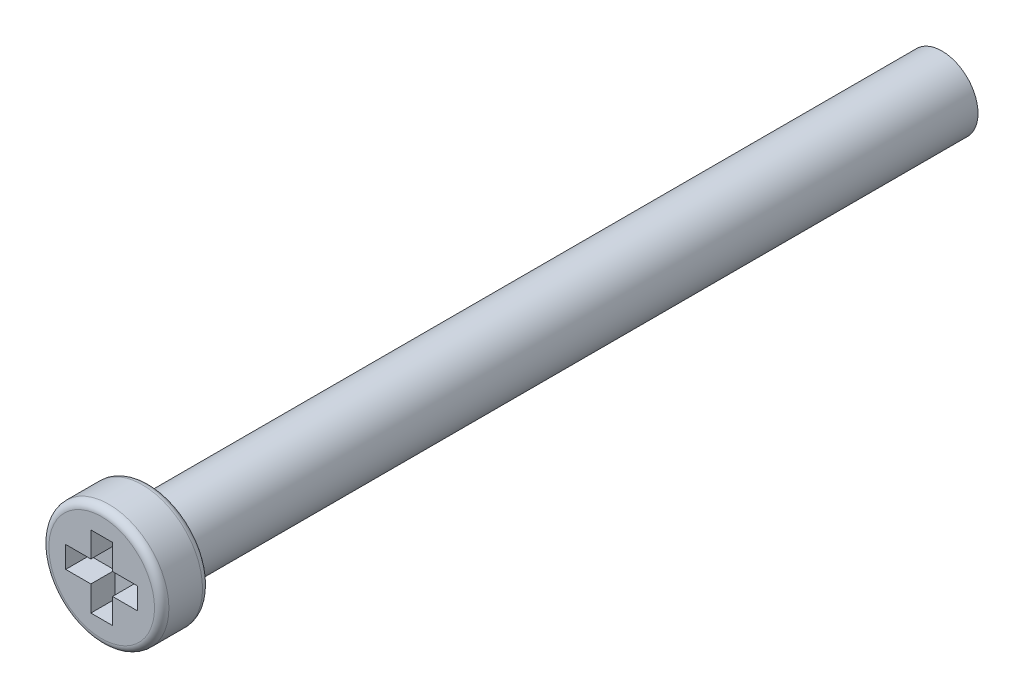
ISO-10303-21;
HEADER;
FILE_DESCRIPTION(('STEP AP214'),'2;1');
FILE_NAME('part.step','',(''),(''),'','','');
FILE_SCHEMA(('AUTOMOTIVE_DESIGN { 1 0 10303 214 1 1 1 1 }'));
ENDSEC;
DATA;
#1=APPLICATION_CONTEXT('core data for automotive mechanical design processes');
#2=APPLICATION_PROTOCOL_DEFINITION('international standard','automotive_design',2000,#1);
#3=PRODUCT_CONTEXT('',#1,'mechanical');
#4=PRODUCT('Part','Part','',(#3));
#5=PRODUCT_RELATED_PRODUCT_CATEGORY('part','',(#4));
#6=PRODUCT_DEFINITION_FORMATION('','',#4);
#7=PRODUCT_DEFINITION_CONTEXT('part definition',#1,'design');
#8=PRODUCT_DEFINITION('design','',#6,#7);
#9=PRODUCT_DEFINITION_SHAPE('','',#8);
#10=(LENGTH_UNIT() NAMED_UNIT(*) SI_UNIT(.MILLI.,.METRE.));
#11=(NAMED_UNIT(*) PLANE_ANGLE_UNIT() SI_UNIT($,.RADIAN.));
#12=(NAMED_UNIT(*) SI_UNIT($,.STERADIAN.) SOLID_ANGLE_UNIT());
#13=UNCERTAINTY_MEASURE_WITH_UNIT(LENGTH_MEASURE(1.E-05),#10,'distance_accuracy_value','');
#14=(GEOMETRIC_REPRESENTATION_CONTEXT(3) GLOBAL_UNCERTAINTY_ASSIGNED_CONTEXT((#13)) GLOBAL_UNIT_ASSIGNED_CONTEXT((#10,
#11,#12)) REPRESENTATION_CONTEXT('',''));
#15=CARTESIAN_POINT('',(0.,0.,0.));
#16=DIRECTION('',(0.,0.,1.));
#17=DIRECTION('',(1.,0.,0.));
#18=AXIS2_PLACEMENT_3D('',#15,#16,#17);
#19=CARTESIAN_POINT('',(0.,0.,0.));
#20=DIRECTION('',(0.,0.,1.));
#21=DIRECTION('',(1.,0.,0.));
#22=AXIS2_PLACEMENT_3D('',#19,#20,#21);
#23=PLANE('',#22);
#24=CARTESIAN_POINT('',(0.,0.,0.));
#25=DIRECTION('',(0.,0.,1.));
#26=DIRECTION('',(1.,0.,0.));
#27=AXIS2_PLACEMENT_3D('',#24,#25,#26);
#28=CIRCLE('',#27,1.6);
#29=CARTESIAN_POINT('',(1.6,0.,0.));
#30=VERTEX_POINT('',#29);
#31=EDGE_CURVE('E11',#30,#30,#28,.T.);
#32=ORIENTED_EDGE('',*,*,#31,.T.);
#33=EDGE_LOOP('',(#32));
#34=FACE_BOUND('',#33,.T.);
#35=CARTESIAN_POINT('',(0.,0.,0.));
#36=DIRECTION('',(0.,0.,1.));
#37=DIRECTION('',(1.,0.,0.));
#38=AXIS2_PLACEMENT_3D('',#35,#36,#37);
#39=CIRCLE('',#38,2.2);
#40=CARTESIAN_POINT('',(2.2,0.,0.));
#41=VERTEX_POINT('',#40);
#42=EDGE_CURVE('E218',#41,#41,#39,.F.);
#43=ORIENTED_EDGE('',*,*,#42,.T.);
#44=EDGE_LOOP('',(#43));
#45=FACE_BOUND('',#44,.T.);
#46=ADVANCED_FACE('F36',(#34,#45),#23,.F.);
#47=CARTESIAN_POINT('',(0.,0.,2.));
#48=DIRECTION('',(0.,0.,-1.));
#49=DIRECTION('',(-1.,0.,0.));
#50=AXIS2_PLACEMENT_3D('',#47,#48,#49);
#51=CYLINDRICAL_SURFACE('',#50,2.5);
#52=CARTESIAN_POINT('',(0.,0.,0.3));
#53=DIRECTION('',(0.,0.,1.));
#54=DIRECTION('',(1.,0.,0.));
#55=AXIS2_PLACEMENT_3D('',#52,#53,#54);
#56=CIRCLE('',#55,2.5);
#57=CARTESIAN_POINT('',(2.5,0.,0.3));
#58=VERTEX_POINT('',#57);
#59=EDGE_CURVE('E215',#58,#58,#56,.T.);
#60=ORIENTED_EDGE('',*,*,#59,.T.);
#61=EDGE_LOOP('',(#60));
#62=FACE_BOUND('',#61,.T.);
#63=CARTESIAN_POINT('',(0.,0.,1.7));
#64=DIRECTION('',(0.,0.,1.));
#65=DIRECTION('',(1.,0.,0.));
#66=AXIS2_PLACEMENT_3D('',#63,#64,#65);
#67=CIRCLE('',#66,2.5);
#68=CARTESIAN_POINT('',(2.5,0.,1.7));
#69=VERTEX_POINT('',#68);
#70=EDGE_CURVE('E212',#69,#69,#67,.F.);
#71=ORIENTED_EDGE('',*,*,#70,.T.);
#72=EDGE_LOOP('',(#71));
#73=FACE_BOUND('',#72,.T.);
#74=ADVANCED_FACE('F238',(#62,#73),#51,.T.);
#75=CARTESIAN_POINT('',(0.,0.,2.));
#76=DIRECTION('',(0.,0.,1.));
#77=DIRECTION('',(1.,0.,0.));
#78=AXIS2_PLACEMENT_3D('',#75,#76,#77);
#79=PLANE('',#78);
#80=DIRECTION('',(0.,1.,0.));
#81=VECTOR('',#80,1.);
#82=CARTESIAN_POINT('',(0.45,-0.45,2.));
#83=LINE('',#82,#81);
#84=CARTESIAN_POINT('',(0.45,-1.5,2.));
#85=VERTEX_POINT('',#84);
#86=CARTESIAN_POINT('',(0.45,-0.45,2.));
#87=VERTEX_POINT('',#86);
#88=EDGE_CURVE('E51',#85,#87,#83,.T.);
#89=ORIENTED_EDGE('',*,*,#88,.F.);
#90=DIRECTION('',(1.,0.,0.));
#91=VECTOR('',#90,1.);
#92=CARTESIAN_POINT('',(-0.45,-1.5,2.));
#93=LINE('',#92,#91);
#94=CARTESIAN_POINT('',(-0.45,-1.5,2.));
#95=VERTEX_POINT('',#94);
#96=EDGE_CURVE('E188',#95,#85,#93,.T.);
#97=ORIENTED_EDGE('',*,*,#96,.F.);
#98=DIRECTION('',(0.,-1.,0.));
#99=VECTOR('',#98,1.);
#100=CARTESIAN_POINT('',(-0.45,-0.45,2.));
#101=LINE('',#100,#99);
#102=CARTESIAN_POINT('',(-0.45,-0.45,2.));
#103=VERTEX_POINT('',#102);
#104=EDGE_CURVE('E186',#103,#95,#101,.T.);
#105=ORIENTED_EDGE('',*,*,#104,.F.);
#106=DIRECTION('',(1.,0.,0.));
#107=VECTOR('',#106,1.);
#108=CARTESIAN_POINT('',(-1.5,-0.45,2.));
#109=LINE('',#108,#107);
#110=CARTESIAN_POINT('',(-1.5,-0.45,2.));
#111=VERTEX_POINT('',#110);
#112=EDGE_CURVE('E135',#111,#103,#109,.T.);
#113=ORIENTED_EDGE('',*,*,#112,.F.);
#114=DIRECTION('',(0.,-1.,0.));
#115=VECTOR('',#114,1.);
#116=CARTESIAN_POINT('',(-1.5,0.45,2.));
#117=LINE('',#116,#115);
#118=CARTESIAN_POINT('',(-1.5,0.45,2.));
#119=VERTEX_POINT('',#118);
#120=EDGE_CURVE('E182',#119,#111,#117,.T.);
#121=ORIENTED_EDGE('',*,*,#120,.F.);
#122=DIRECTION('',(-1.,0.,0.));
#123=VECTOR('',#122,1.);
#124=CARTESIAN_POINT('',(-1.5,0.45,2.));
#125=LINE('',#124,#123);
#126=CARTESIAN_POINT('',(-0.45,0.45,2.));
#127=VERTEX_POINT('',#126);
#128=EDGE_CURVE('E179',#127,#119,#125,.T.);
#129=ORIENTED_EDGE('',*,*,#128,.F.);
#130=DIRECTION('',(0.,-1.,0.));
#131=VECTOR('',#130,1.);
#132=CARTESIAN_POINT('',(-0.45,1.5,2.));
#133=LINE('',#132,#131);
#134=CARTESIAN_POINT('',(-0.45,1.5,2.));
#135=VERTEX_POINT('',#134);
#136=EDGE_CURVE('E176',#135,#127,#133,.T.);
#137=ORIENTED_EDGE('',*,*,#136,.F.);
#138=DIRECTION('',(-1.,0.,0.));
#139=VECTOR('',#138,1.);
#140=CARTESIAN_POINT('',(-0.45,1.5,2.));
#141=LINE('',#140,#139);
#142=CARTESIAN_POINT('',(0.45,1.5,2.));
#143=VERTEX_POINT('',#142);
#144=EDGE_CURVE('E173',#143,#135,#141,.T.);
#145=ORIENTED_EDGE('',*,*,#144,.F.);
#146=DIRECTION('',(0.,1.,0.));
#147=VECTOR('',#146,1.);
#148=CARTESIAN_POINT('',(0.45,1.5,2.));
#149=LINE('',#148,#147);
#150=CARTESIAN_POINT('',(0.45,0.45,2.));
#151=VERTEX_POINT('',#150);
#152=EDGE_CURVE('E170',#151,#143,#149,.T.);
#153=ORIENTED_EDGE('',*,*,#152,.F.);
#154=DIRECTION('',(-1.,0.,0.));
#155=VECTOR('',#154,1.);
#156=CARTESIAN_POINT('',(0.45,0.45,2.));
#157=LINE('',#156,#155);
#158=CARTESIAN_POINT('',(1.5,0.45,2.));
#159=VERTEX_POINT('',#158);
#160=EDGE_CURVE('E167',#159,#151,#157,.T.);
#161=ORIENTED_EDGE('',*,*,#160,.F.);
#162=DIRECTION('',(0.,1.,0.));
#163=VECTOR('',#162,1.);
#164=CARTESIAN_POINT('',(1.5,0.45,2.));
#165=LINE('',#164,#163);
#166=CARTESIAN_POINT('',(1.5,-0.45,2.));
#167=VERTEX_POINT('',#166);
#168=EDGE_CURVE('E164',#167,#159,#165,.T.);
#169=ORIENTED_EDGE('',*,*,#168,.F.);
#170=DIRECTION('',(1.,0.,0.));
#171=VECTOR('',#170,1.);
#172=CARTESIAN_POINT('',(0.45,-0.45,2.));
#173=LINE('',#172,#171);
#174=EDGE_CURVE('E161',#87,#167,#173,.T.);
#175=ORIENTED_EDGE('',*,*,#174,.F.);
#176=EDGE_LOOP('',(#89,#97,#105,#113,#121,#129,#137,#145,#153,#161,#169,#175));
#177=FACE_BOUND('',#176,.T.);
#178=CARTESIAN_POINT('',(0.,0.,2.));
#179=DIRECTION('',(0.,0.,1.));
#180=DIRECTION('',(1.,0.,0.));
#181=AXIS2_PLACEMENT_3D('',#178,#179,#180);
#182=CIRCLE('',#181,2.2);
#183=CARTESIAN_POINT('',(2.2,0.,2.));
#184=VERTEX_POINT('',#183);
#185=EDGE_CURVE('E221',#184,#184,#182,.T.);
#186=ORIENTED_EDGE('',*,*,#185,.T.);
#187=EDGE_LOOP('',(#186));
#188=FACE_BOUND('',#187,.T.);
#189=ADVANCED_FACE('F244',(#177,#188),#79,.T.);
#190=CARTESIAN_POINT('',(0.,0.,-33.));
#191=DIRECTION('',(0.,0.,1.));
#192=DIRECTION('',(1.,0.,0.));
#193=AXIS2_PLACEMENT_3D('',#190,#191,#192);
#194=CYLINDRICAL_SURFACE('',#193,1.5);
#195=CARTESIAN_POINT('',(0.,0.,-0.100000000000003));
#196=DIRECTION('',(0.,0.,1.));
#197=DIRECTION('',(1.,0.,0.));
#198=AXIS2_PLACEMENT_3D('',#195,#196,#197);
#199=CIRCLE('',#198,1.5);
#200=CARTESIAN_POINT('',(1.5,0.,-0.100000000000003));
#201=VERTEX_POINT('',#200);
#202=EDGE_CURVE('E44',#201,#201,#199,.F.);
#203=ORIENTED_EDGE('',*,*,#202,.T.);
#204=EDGE_LOOP('',(#203));
#205=FACE_BOUND('',#204,.T.);
#206=CARTESIAN_POINT('',(0.,0.,-33.));
#207=DIRECTION('',(0.,0.,-1.));
#208=DIRECTION('',(-1.,0.,0.));
#209=AXIS2_PLACEMENT_3D('',#206,#207,#208);
#210=CIRCLE('',#209,1.5);
#211=CARTESIAN_POINT('',(-1.5,0.,-33.));
#212=VERTEX_POINT('',#211);
#213=EDGE_CURVE('E192',#212,#212,#210,.T.);
#214=ORIENTED_EDGE('',*,*,#213,.F.);
#215=EDGE_LOOP('',(#214));
#216=FACE_BOUND('',#215,.T.);
#217=ADVANCED_FACE('F226',(#205,#216),#194,.T.);
#218=CARTESIAN_POINT('',(0.,0.,-33.));
#219=DIRECTION('',(0.,0.,-1.));
#220=DIRECTION('',(-1.,0.,0.));
#221=AXIS2_PLACEMENT_3D('',#218,#219,#220);
#222=PLANE('',#221);
#223=ORIENTED_EDGE('',*,*,#213,.T.);
#224=EDGE_LOOP('',(#223));
#225=FACE_BOUND('',#224,.T.);
#226=ADVANCED_FACE('F254',(#225),#222,.T.);
#227=CARTESIAN_POINT('',(0.,0.,0.3));
#228=DIRECTION('',(0.,0.,1.));
#229=DIRECTION('',(1.,0.,0.));
#230=AXIS2_PLACEMENT_3D('',#227,#228,#229);
#231=TOROIDAL_SURFACE('',#230,2.2,0.3);
#232=ORIENTED_EDGE('',*,*,#42,.F.);
#233=EDGE_LOOP('',(#232));
#234=FACE_BOUND('',#233,.T.);
#235=ORIENTED_EDGE('',*,*,#59,.F.);
#236=EDGE_LOOP('',(#235));
#237=FACE_BOUND('',#236,.T.);
#238=ADVANCED_FACE('F251',(#234,#237),#231,.T.);
#239=CARTESIAN_POINT('',(0.,0.,1.7));
#240=DIRECTION('',(0.,0.,1.));
#241=DIRECTION('',(1.,0.,0.));
#242=AXIS2_PLACEMENT_3D('',#239,#240,#241);
#243=TOROIDAL_SURFACE('',#242,2.2,0.3);
#244=ORIENTED_EDGE('',*,*,#70,.F.);
#245=EDGE_LOOP('',(#244));
#246=FACE_BOUND('',#245,.T.);
#247=ORIENTED_EDGE('',*,*,#185,.F.);
#248=EDGE_LOOP('',(#247));
#249=FACE_BOUND('',#248,.T.);
#250=ADVANCED_FACE('F253',(#246,#249),#243,.T.);
#251=CARTESIAN_POINT('',(0.45,-0.45,1.));
#252=DIRECTION('',(1.,0.,0.));
#253=DIRECTION('',(0.,1.,0.));
#254=AXIS2_PLACEMENT_3D('',#251,#252,#253);
#255=PLANE('',#254);
#256=ORIENTED_EDGE('',*,*,#88,.T.);
#257=DIRECTION('',(0.,0.,1.));
#258=VECTOR('',#257,1.);
#259=CARTESIAN_POINT('',(0.45,-0.45,1.));
#260=LINE('',#259,#258);
#261=CARTESIAN_POINT('',(0.45,-0.45,1.));
#262=VERTEX_POINT('',#261);
#263=EDGE_CURVE('E99',#262,#87,#260,.T.);
#264=ORIENTED_EDGE('',*,*,#263,.F.);
#265=DIRECTION('',(0.,1.,0.));
#266=VECTOR('',#265,1.);
#267=CARTESIAN_POINT('',(0.45,-0.45,1.));
#268=LINE('',#267,#266);
#269=CARTESIAN_POINT('',(0.45,-1.5,1.));
#270=VERTEX_POINT('',#269);
#271=EDGE_CURVE('E190',#270,#262,#268,.T.);
#272=ORIENTED_EDGE('',*,*,#271,.F.);
#273=DIRECTION('',(0.,0.,1.));
#274=VECTOR('',#273,1.);
#275=CARTESIAN_POINT('',(0.45,-1.5,1.));
#276=LINE('',#275,#274);
#277=EDGE_CURVE('E59',#270,#85,#276,.T.);
#278=ORIENTED_EDGE('',*,*,#277,.T.);
#279=EDGE_LOOP('',(#256,#264,#272,#278));
#280=FACE_BOUND('',#279,.T.);
#281=ADVANCED_FACE('F257',(#280),#255,.F.);
#282=CARTESIAN_POINT('',(-0.45,-1.5,1.));
#283=DIRECTION('',(0.,-1.,0.));
#284=DIRECTION('',(0.,0.,-1.));
#285=AXIS2_PLACEMENT_3D('',#282,#283,#284);
#286=PLANE('',#285);
#287=ORIENTED_EDGE('',*,*,#96,.T.);
#288=ORIENTED_EDGE('',*,*,#277,.F.);
#289=DIRECTION('',(1.,0.,0.));
#290=VECTOR('',#289,1.);
#291=CARTESIAN_POINT('',(-0.45,-1.5,1.));
#292=LINE('',#291,#290);
#293=CARTESIAN_POINT('',(-0.45,-1.5,1.));
#294=VERTEX_POINT('',#293);
#295=EDGE_CURVE('E147',#294,#270,#292,.T.);
#296=ORIENTED_EDGE('',*,*,#295,.F.);
#297=DIRECTION('',(0.,0.,1.));
#298=VECTOR('',#297,1.);
#299=CARTESIAN_POINT('',(-0.45,-1.5,1.));
#300=LINE('',#299,#298);
#301=EDGE_CURVE('E139',#294,#95,#300,.T.);
#302=ORIENTED_EDGE('',*,*,#301,.T.);
#303=EDGE_LOOP('',(#287,#288,#296,#302));
#304=FACE_BOUND('',#303,.T.);
#305=ADVANCED_FACE('F262',(#304),#286,.F.);
#306=CARTESIAN_POINT('',(-0.45,-0.45,1.));
#307=DIRECTION('',(-1.,0.,0.));
#308=DIRECTION('',(0.,-1.,0.));
#309=AXIS2_PLACEMENT_3D('',#306,#307,#308);
#310=PLANE('',#309);
#311=ORIENTED_EDGE('',*,*,#104,.T.);
#312=ORIENTED_EDGE('',*,*,#301,.F.);
#313=DIRECTION('',(0.,-1.,0.));
#314=VECTOR('',#313,1.);
#315=CARTESIAN_POINT('',(-0.45,-0.45,1.));
#316=LINE('',#315,#314);
#317=CARTESIAN_POINT('',(-0.45,-0.45,1.));
#318=VERTEX_POINT('',#317);
#319=EDGE_CURVE('E143',#318,#294,#316,.T.);
#320=ORIENTED_EDGE('',*,*,#319,.F.);
#321=DIRECTION('',(0.,0.,1.));
#322=VECTOR('',#321,1.);
#323=CARTESIAN_POINT('',(-0.45,-0.45,1.));
#324=LINE('',#323,#322);
#325=EDGE_CURVE('E128',#318,#103,#324,.T.);
#326=ORIENTED_EDGE('',*,*,#325,.T.);
#327=EDGE_LOOP('',(#311,#312,#320,#326));
#328=FACE_BOUND('',#327,.T.);
#329=ADVANCED_FACE('F144',(#328),#310,.F.);
#330=CARTESIAN_POINT('',(-1.5,-0.45,1.));
#331=DIRECTION('',(0.,-1.,0.));
#332=DIRECTION('',(1.,0.,0.));
#333=AXIS2_PLACEMENT_3D('',#330,#331,#332);
#334=PLANE('',#333);
#335=ORIENTED_EDGE('',*,*,#112,.T.);
#336=ORIENTED_EDGE('',*,*,#325,.F.);
#337=DIRECTION('',(1.,0.,0.));
#338=VECTOR('',#337,1.);
#339=CARTESIAN_POINT('',(-1.5,-0.45,1.));
#340=LINE('',#339,#338);
#341=CARTESIAN_POINT('',(-1.5,-0.45,1.));
#342=VERTEX_POINT('',#341);
#343=EDGE_CURVE('E132',#342,#318,#340,.T.);
#344=ORIENTED_EDGE('',*,*,#343,.F.);
#345=DIRECTION('',(0.,0.,1.));
#346=VECTOR('',#345,1.);
#347=CARTESIAN_POINT('',(-1.5,-0.45,1.));
#348=LINE('',#347,#346);
#349=EDGE_CURVE('E140',#342,#111,#348,.T.);
#350=ORIENTED_EDGE('',*,*,#349,.T.);
#351=EDGE_LOOP('',(#335,#336,#344,#350));
#352=FACE_BOUND('',#351,.T.);
#353=ADVANCED_FACE('F130',(#352),#334,.F.);
#354=CARTESIAN_POINT('',(-1.5,0.45,1.));
#355=DIRECTION('',(-1.,0.,0.));
#356=DIRECTION('',(0.,-1.,0.));
#357=AXIS2_PLACEMENT_3D('',#354,#355,#356);
#358=PLANE('',#357);
#359=ORIENTED_EDGE('',*,*,#120,.T.);
#360=ORIENTED_EDGE('',*,*,#349,.F.);
#361=DIRECTION('',(0.,-1.,0.));
#362=VECTOR('',#361,1.);
#363=CARTESIAN_POINT('',(-1.5,0.45,1.));
#364=LINE('',#363,#362);
#365=CARTESIAN_POINT('',(-1.5,0.45,1.));
#366=VERTEX_POINT('',#365);
#367=EDGE_CURVE('E153',#366,#342,#364,.T.);
#368=ORIENTED_EDGE('',*,*,#367,.F.);
#369=DIRECTION('',(0.,0.,1.));
#370=VECTOR('',#369,1.);
#371=CARTESIAN_POINT('',(-1.5,0.45,1.));
#372=LINE('',#371,#370);
#373=EDGE_CURVE('E195',#366,#119,#372,.T.);
#374=ORIENTED_EDGE('',*,*,#373,.T.);
#375=EDGE_LOOP('',(#359,#360,#368,#374));
#376=FACE_BOUND('',#375,.T.);
#377=ADVANCED_FACE('F305',(#376),#358,.F.);
#378=CARTESIAN_POINT('',(-1.5,0.45,1.));
#379=DIRECTION('',(0.,1.,0.));
#380=DIRECTION('',(0.,0.,1.));
#381=AXIS2_PLACEMENT_3D('',#378,#379,#380);
#382=PLANE('',#381);
#383=ORIENTED_EDGE('',*,*,#128,.T.);
#384=ORIENTED_EDGE('',*,*,#373,.F.);
#385=DIRECTION('',(-1.,0.,0.));
#386=VECTOR('',#385,1.);
#387=CARTESIAN_POINT('',(-1.5,0.45,1.));
#388=LINE('',#387,#386);
#389=CARTESIAN_POINT('',(-0.45,0.45,1.));
#390=VERTEX_POINT('',#389);
#391=EDGE_CURVE('E155',#390,#366,#388,.T.);
#392=ORIENTED_EDGE('',*,*,#391,.F.);
#393=DIRECTION('',(0.,0.,1.));
#394=VECTOR('',#393,1.);
#395=CARTESIAN_POINT('',(-0.45,0.45,1.));
#396=LINE('',#395,#394);
#397=EDGE_CURVE('E197',#390,#127,#396,.T.);
#398=ORIENTED_EDGE('',*,*,#397,.T.);
#399=EDGE_LOOP('',(#383,#384,#392,#398));
#400=FACE_BOUND('',#399,.T.);
#401=ADVANCED_FACE('F301',(#400),#382,.F.);
#402=CARTESIAN_POINT('',(-0.45,1.5,1.));
#403=DIRECTION('',(-1.,0.,0.));
#404=DIRECTION('',(0.,-1.,0.));
#405=AXIS2_PLACEMENT_3D('',#402,#403,#404);
#406=PLANE('',#405);
#407=ORIENTED_EDGE('',*,*,#136,.T.);
#408=ORIENTED_EDGE('',*,*,#397,.F.);
#409=DIRECTION('',(0.,-1.,0.));
#410=VECTOR('',#409,1.);
#411=CARTESIAN_POINT('',(-0.45,1.5,1.));
#412=LINE('',#411,#410);
#413=CARTESIAN_POINT('',(-0.45,1.5,1.));
#414=VERTEX_POINT('',#413);
#415=EDGE_CURVE('E296',#414,#390,#412,.T.);
#416=ORIENTED_EDGE('',*,*,#415,.F.);
#417=DIRECTION('',(0.,0.,1.));
#418=VECTOR('',#417,1.);
#419=CARTESIAN_POINT('',(-0.45,1.5,1.));
#420=LINE('',#419,#418);
#421=EDGE_CURVE('E199',#414,#135,#420,.T.);
#422=ORIENTED_EDGE('',*,*,#421,.T.);
#423=EDGE_LOOP('',(#407,#408,#416,#422));
#424=FACE_BOUND('',#423,.T.);
#425=ADVANCED_FACE('F310',(#424),#406,.F.);
#426=CARTESIAN_POINT('',(-0.45,1.5,1.));
#427=DIRECTION('',(0.,1.,0.));
#428=DIRECTION('',(0.,0.,1.));
#429=AXIS2_PLACEMENT_3D('',#426,#427,#428);
#430=PLANE('',#429);
#431=ORIENTED_EDGE('',*,*,#144,.T.);
#432=ORIENTED_EDGE('',*,*,#421,.F.);
#433=DIRECTION('',(-1.,0.,0.));
#434=VECTOR('',#433,1.);
#435=CARTESIAN_POINT('',(-0.45,1.5,1.));
#436=LINE('',#435,#434);
#437=CARTESIAN_POINT('',(0.45,1.5,1.));
#438=VERTEX_POINT('',#437);
#439=EDGE_CURVE('E293',#438,#414,#436,.T.);
#440=ORIENTED_EDGE('',*,*,#439,.F.);
#441=DIRECTION('',(0.,0.,1.));
#442=VECTOR('',#441,1.);
#443=CARTESIAN_POINT('',(0.45,1.5,1.));
#444=LINE('',#443,#442);
#445=EDGE_CURVE('E201',#438,#143,#444,.T.);
#446=ORIENTED_EDGE('',*,*,#445,.T.);
#447=EDGE_LOOP('',(#431,#432,#440,#446));
#448=FACE_BOUND('',#447,.T.);
#449=ADVANCED_FACE('F313',(#448),#430,.F.);
#450=CARTESIAN_POINT('',(0.45,1.5,1.));
#451=DIRECTION('',(1.,0.,0.));
#452=DIRECTION('',(0.,1.,0.));
#453=AXIS2_PLACEMENT_3D('',#450,#451,#452);
#454=PLANE('',#453);
#455=ORIENTED_EDGE('',*,*,#152,.T.);
#456=ORIENTED_EDGE('',*,*,#445,.F.);
#457=DIRECTION('',(0.,1.,0.));
#458=VECTOR('',#457,1.);
#459=CARTESIAN_POINT('',(0.45,1.5,1.));
#460=LINE('',#459,#458);
#461=CARTESIAN_POINT('',(0.45,0.45,1.));
#462=VERTEX_POINT('',#461);
#463=EDGE_CURVE('E290',#462,#438,#460,.T.);
#464=ORIENTED_EDGE('',*,*,#463,.F.);
#465=DIRECTION('',(0.,0.,1.));
#466=VECTOR('',#465,1.);
#467=CARTESIAN_POINT('',(0.45,0.45,1.));
#468=LINE('',#467,#466);
#469=EDGE_CURVE('E203',#462,#151,#468,.T.);
#470=ORIENTED_EDGE('',*,*,#469,.T.);
#471=EDGE_LOOP('',(#455,#456,#464,#470));
#472=FACE_BOUND('',#471,.T.);
#473=ADVANCED_FACE('F316',(#472),#454,.F.);
#474=CARTESIAN_POINT('',(0.45,0.45,1.));
#475=DIRECTION('',(0.,1.,0.));
#476=DIRECTION('',(-1.,0.,0.));
#477=AXIS2_PLACEMENT_3D('',#474,#475,#476);
#478=PLANE('',#477);
#479=ORIENTED_EDGE('',*,*,#160,.T.);
#480=ORIENTED_EDGE('',*,*,#469,.F.);
#481=DIRECTION('',(-1.,0.,0.));
#482=VECTOR('',#481,1.);
#483=CARTESIAN_POINT('',(0.45,0.45,1.));
#484=LINE('',#483,#482);
#485=CARTESIAN_POINT('',(1.5,0.45,1.));
#486=VERTEX_POINT('',#485);
#487=EDGE_CURVE('E287',#486,#462,#484,.T.);
#488=ORIENTED_EDGE('',*,*,#487,.F.);
#489=DIRECTION('',(0.,0.,1.));
#490=VECTOR('',#489,1.);
#491=CARTESIAN_POINT('',(1.5,0.45,1.));
#492=LINE('',#491,#490);
#493=EDGE_CURVE('E205',#486,#159,#492,.T.);
#494=ORIENTED_EDGE('',*,*,#493,.T.);
#495=EDGE_LOOP('',(#479,#480,#488,#494));
#496=FACE_BOUND('',#495,.T.);
#497=ADVANCED_FACE('F318',(#496),#478,.F.);
#498=CARTESIAN_POINT('',(1.5,0.45,1.));
#499=DIRECTION('',(1.,0.,0.));
#500=DIRECTION('',(0.,1.,0.));
#501=AXIS2_PLACEMENT_3D('',#498,#499,#500);
#502=PLANE('',#501);
#503=ORIENTED_EDGE('',*,*,#168,.T.);
#504=ORIENTED_EDGE('',*,*,#493,.F.);
#505=DIRECTION('',(0.,1.,0.));
#506=VECTOR('',#505,1.);
#507=CARTESIAN_POINT('',(1.5,0.45,1.));
#508=LINE('',#507,#506);
#509=CARTESIAN_POINT('',(1.5,-0.45,1.));
#510=VERTEX_POINT('',#509);
#511=EDGE_CURVE('E282',#510,#486,#508,.T.);
#512=ORIENTED_EDGE('',*,*,#511,.F.);
#513=DIRECTION('',(0.,0.,1.));
#514=VECTOR('',#513,1.);
#515=CARTESIAN_POINT('',(1.5,-0.45,1.));
#516=LINE('',#515,#514);
#517=EDGE_CURVE('E207',#510,#167,#516,.T.);
#518=ORIENTED_EDGE('',*,*,#517,.T.);
#519=EDGE_LOOP('',(#503,#504,#512,#518));
#520=FACE_BOUND('',#519,.T.);
#521=ADVANCED_FACE('F321',(#520),#502,.F.);
#522=CARTESIAN_POINT('',(0.45,-0.45,1.));
#523=DIRECTION('',(0.,-1.,0.));
#524=DIRECTION('',(1.,0.,0.));
#525=AXIS2_PLACEMENT_3D('',#522,#523,#524);
#526=PLANE('',#525);
#527=ORIENTED_EDGE('',*,*,#174,.T.);
#528=ORIENTED_EDGE('',*,*,#517,.F.);
#529=DIRECTION('',(1.,0.,0.));
#530=VECTOR('',#529,1.);
#531=CARTESIAN_POINT('',(0.45,-0.45,1.));
#532=LINE('',#531,#530);
#533=EDGE_CURVE('E280',#262,#510,#532,.T.);
#534=ORIENTED_EDGE('',*,*,#533,.F.);
#535=ORIENTED_EDGE('',*,*,#263,.T.);
#536=EDGE_LOOP('',(#527,#528,#534,#535));
#537=FACE_BOUND('',#536,.T.);
#538=ADVANCED_FACE('F234',(#537),#526,.F.);
#539=CARTESIAN_POINT('',(0.,0.,1.));
#540=DIRECTION('',(0.,0.,1.));
#541=DIRECTION('',(1.,0.,0.));
#542=AXIS2_PLACEMENT_3D('',#539,#540,#541);
#543=PLANE('',#542);
#544=ORIENTED_EDGE('',*,*,#271,.T.);
#545=ORIENTED_EDGE('',*,*,#533,.T.);
#546=ORIENTED_EDGE('',*,*,#511,.T.);
#547=ORIENTED_EDGE('',*,*,#487,.T.);
#548=ORIENTED_EDGE('',*,*,#463,.T.);
#549=ORIENTED_EDGE('',*,*,#439,.T.);
#550=ORIENTED_EDGE('',*,*,#415,.T.);
#551=ORIENTED_EDGE('',*,*,#391,.T.);
#552=ORIENTED_EDGE('',*,*,#367,.T.);
#553=ORIENTED_EDGE('',*,*,#343,.T.);
#554=ORIENTED_EDGE('',*,*,#319,.T.);
#555=ORIENTED_EDGE('',*,*,#295,.T.);
#556=EDGE_LOOP('',(#544,#545,#546,#547,#548,#549,#550,#551,#552,#553,#554,#555));
#557=FACE_BOUND('',#556,.T.);
#558=ADVANCED_FACE('F150',(#557),#543,.T.);
#559=CARTESIAN_POINT('',(0.,0.,-0.100000000000003));
#560=DIRECTION('',(0.,0.,1.));
#561=DIRECTION('',(1.,0.,0.));
#562=AXIS2_PLACEMENT_3D('',#559,#560,#561);
#563=TOROIDAL_SURFACE('',#562,1.6,0.1);
#564=ORIENTED_EDGE('',*,*,#31,.F.);
#565=EDGE_LOOP('',(#564));
#566=FACE_BOUND('',#565,.T.);
#567=ORIENTED_EDGE('',*,*,#202,.F.);
#568=EDGE_LOOP('',(#567));
#569=FACE_BOUND('',#568,.T.);
#570=ADVANCED_FACE('F38',(#566,#569),#563,.F.);
#571=CLOSED_SHELL('',(#46,#74,#189,#217,#226,#238,#250,#281,#305,#329,#353,#377,#401,#425,#449,
#473,#497,#521,#538,#558,#570));
#572=MANIFOLD_SOLID_BREP('B2',#571);
#573=ADVANCED_BREP_SHAPE_REPRESENTATION('',(#18,#572),#14);
#574=SHAPE_DEFINITION_REPRESENTATION(#9,#573);
ENDSEC;
END-ISO-10303-21;
